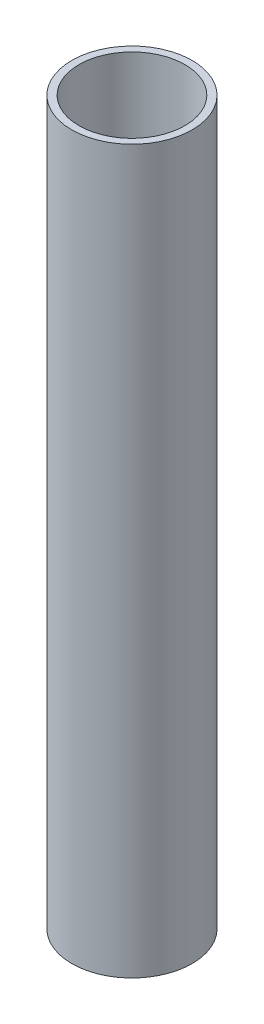
ISO-10303-21;
HEADER;
FILE_DESCRIPTION(('STEP AP214'),'2;1');
FILE_NAME('part.step','',(''),(''),'','','');
FILE_SCHEMA(('AUTOMOTIVE_DESIGN { 1 0 10303 214 1 1 1 1 }'));
ENDSEC;
DATA;
#1=APPLICATION_CONTEXT('core data for automotive mechanical design processes');
#2=APPLICATION_PROTOCOL_DEFINITION('international standard','automotive_design',2000,#1);
#3=PRODUCT_CONTEXT('',#1,'mechanical');
#4=PRODUCT('Part','Part','',(#3));
#5=PRODUCT_RELATED_PRODUCT_CATEGORY('part','',(#4));
#6=PRODUCT_DEFINITION_FORMATION('','',#4);
#7=PRODUCT_DEFINITION_CONTEXT('part definition',#1,'design');
#8=PRODUCT_DEFINITION('design','',#6,#7);
#9=PRODUCT_DEFINITION_SHAPE('','',#8);
#10=(LENGTH_UNIT() NAMED_UNIT(*) SI_UNIT(.MILLI.,.METRE.));
#11=(NAMED_UNIT(*) PLANE_ANGLE_UNIT() SI_UNIT($,.RADIAN.));
#12=(NAMED_UNIT(*) SI_UNIT($,.STERADIAN.) SOLID_ANGLE_UNIT());
#13=UNCERTAINTY_MEASURE_WITH_UNIT(LENGTH_MEASURE(1.E-05),#10,'distance_accuracy_value','');
#14=(GEOMETRIC_REPRESENTATION_CONTEXT(3) GLOBAL_UNCERTAINTY_ASSIGNED_CONTEXT((#13)) GLOBAL_UNIT_ASSIGNED_CONTEXT((#10,
#11,#12)) REPRESENTATION_CONTEXT('',''));
#15=CARTESIAN_POINT('',(0.,0.,0.));
#16=DIRECTION('',(0.,0.,1.));
#17=DIRECTION('',(1.,0.,0.));
#18=AXIS2_PLACEMENT_3D('',#15,#16,#17);
#19=CARTESIAN_POINT('',(0.,152.4,0.));
#20=DIRECTION('',(0.,1.,0.));
#21=DIRECTION('',(0.,0.,1.));
#22=AXIS2_PLACEMENT_3D('',#19,#20,#21);
#23=PLANE('',#22);
#24=CARTESIAN_POINT('',(0.,152.4,0.));
#25=DIRECTION('',(0.,1.,0.));
#26=DIRECTION('',(0.,0.,1.));
#27=AXIS2_PLACEMENT_3D('',#24,#25,#26);
#28=CIRCLE('',#27,12.7);
#29=CARTESIAN_POINT('',(0.,152.4,12.7));
#30=VERTEX_POINT('',#29);
#31=EDGE_CURVE('E10',#30,#30,#28,.T.);
#32=ORIENTED_EDGE('',*,*,#31,.T.);
#33=EDGE_LOOP('',(#32));
#34=FACE_BOUND('',#33,.T.);
#35=CARTESIAN_POINT('',(0.,152.4,0.));
#36=DIRECTION('',(0.,1.,0.));
#37=DIRECTION('',(0.,0.,1.));
#38=AXIS2_PLACEMENT_3D('',#35,#36,#37);
#39=CIRCLE('',#38,11.176);
#40=CARTESIAN_POINT('',(0.,152.4,11.176));
#41=VERTEX_POINT('',#40);
#42=EDGE_CURVE('E42',#41,#41,#39,.T.);
#43=ORIENTED_EDGE('',*,*,#42,.F.);
#44=EDGE_LOOP('',(#43));
#45=FACE_BOUND('',#44,.T.);
#46=ADVANCED_FACE('F31',(#34,#45),#23,.T.);
#47=CARTESIAN_POINT('',(0.,0.,0.));
#48=DIRECTION('',(0.,1.,0.));
#49=DIRECTION('',(0.,0.,1.));
#50=AXIS2_PLACEMENT_3D('',#47,#48,#49);
#51=PLANE('',#50);
#52=CARTESIAN_POINT('',(0.,0.,0.));
#53=DIRECTION('',(0.,1.,0.));
#54=DIRECTION('',(0.,0.,1.));
#55=AXIS2_PLACEMENT_3D('',#52,#53,#54);
#56=CIRCLE('',#55,12.7);
#57=CARTESIAN_POINT('',(0.,0.,12.7));
#58=VERTEX_POINT('',#57);
#59=EDGE_CURVE('E35',#58,#58,#56,.T.);
#60=ORIENTED_EDGE('',*,*,#59,.F.);
#61=EDGE_LOOP('',(#60));
#62=FACE_BOUND('',#61,.T.);
#63=CARTESIAN_POINT('',(0.,0.,0.));
#64=DIRECTION('',(0.,1.,0.));
#65=DIRECTION('',(0.,0.,1.));
#66=AXIS2_PLACEMENT_3D('',#63,#64,#65);
#67=CIRCLE('',#66,11.176);
#68=CARTESIAN_POINT('',(0.,0.,11.176));
#69=VERTEX_POINT('',#68);
#70=EDGE_CURVE('E44',#69,#69,#67,.T.);
#71=ORIENTED_EDGE('',*,*,#70,.T.);
#72=EDGE_LOOP('',(#71));
#73=FACE_BOUND('',#72,.T.);
#74=ADVANCED_FACE('F54',(#62,#73),#51,.F.);
#75=CARTESIAN_POINT('',(0.,152.4,0.));
#76=DIRECTION('',(0.,-1.,0.));
#77=DIRECTION('',(0.,0.,-1.));
#78=AXIS2_PLACEMENT_3D('',#75,#76,#77);
#79=CYLINDRICAL_SURFACE('',#78,12.7);
#80=ORIENTED_EDGE('',*,*,#31,.F.);
#81=EDGE_LOOP('',(#80));
#82=FACE_BOUND('',#81,.T.);
#83=ORIENTED_EDGE('',*,*,#59,.T.);
#84=EDGE_LOOP('',(#83));
#85=FACE_BOUND('',#84,.T.);
#86=ADVANCED_FACE('F33',(#82,#85),#79,.T.);
#87=CARTESIAN_POINT('',(0.,152.4,0.));
#88=DIRECTION('',(0.,-1.,0.));
#89=DIRECTION('',(0.,0.,-1.));
#90=AXIS2_PLACEMENT_3D('',#87,#88,#89);
#91=CYLINDRICAL_SURFACE('',#90,11.176);
#92=ORIENTED_EDGE('',*,*,#42,.T.);
#93=EDGE_LOOP('',(#92));
#94=FACE_BOUND('',#93,.T.);
#95=ORIENTED_EDGE('',*,*,#70,.F.);
#96=EDGE_LOOP('',(#95));
#97=FACE_BOUND('',#96,.T.);
#98=ADVANCED_FACE('F50',(#94,#97),#91,.F.);
#99=CLOSED_SHELL('',(#46,#74,#86,#98));
#100=MANIFOLD_SOLID_BREP('B2',#99);
#101=ADVANCED_BREP_SHAPE_REPRESENTATION('',(#18,#100),#14);
#102=SHAPE_DEFINITION_REPRESENTATION(#9,#101);
ENDSEC;
END-ISO-10303-21;
